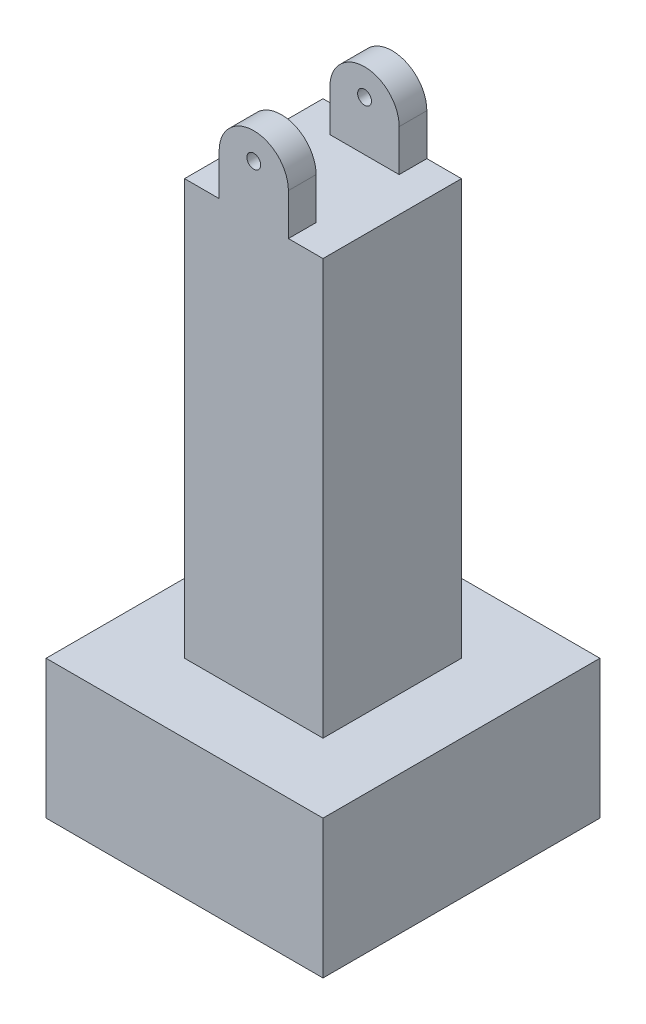
ISO-10303-21;
HEADER;
FILE_DESCRIPTION(('STEP AP214'),'2;1');
FILE_NAME('part.step','',(''),(''),'','','');
FILE_SCHEMA(('AUTOMOTIVE_DESIGN { 1 0 10303 214 1 1 1 1 }'));
ENDSEC;
DATA;
#1=APPLICATION_CONTEXT('core data for automotive mechanical design processes');
#2=APPLICATION_PROTOCOL_DEFINITION('international standard','automotive_design',2000,#1);
#3=PRODUCT_CONTEXT('',#1,'mechanical');
#4=PRODUCT('Part','Part','',(#3));
#5=PRODUCT_RELATED_PRODUCT_CATEGORY('part','',(#4));
#6=PRODUCT_DEFINITION_FORMATION('','',#4);
#7=PRODUCT_DEFINITION_CONTEXT('part definition',#1,'design');
#8=PRODUCT_DEFINITION('design','',#6,#7);
#9=PRODUCT_DEFINITION_SHAPE('','',#8);
#10=(LENGTH_UNIT() NAMED_UNIT(*) SI_UNIT(.MILLI.,.METRE.));
#11=(NAMED_UNIT(*) PLANE_ANGLE_UNIT() SI_UNIT($,.RADIAN.));
#12=(NAMED_UNIT(*) SI_UNIT($,.STERADIAN.) SOLID_ANGLE_UNIT());
#13=UNCERTAINTY_MEASURE_WITH_UNIT(LENGTH_MEASURE(1.E-05),#10,'distance_accuracy_value','');
#14=(GEOMETRIC_REPRESENTATION_CONTEXT(3) GLOBAL_UNCERTAINTY_ASSIGNED_CONTEXT((#13)) GLOBAL_UNIT_ASSIGNED_CONTEXT((#10,
#11,#12)) REPRESENTATION_CONTEXT('',''));
#15=CARTESIAN_POINT('',(0.,0.,0.));
#16=DIRECTION('',(0.,0.,1.));
#17=DIRECTION('',(1.,0.,0.));
#18=AXIS2_PLACEMENT_3D('',#15,#16,#17);
#19=CARTESIAN_POINT('',(0.,40.,0.));
#20=DIRECTION('',(0.,-1.,0.));
#21=DIRECTION('',(0.,0.,-1.));
#22=AXIS2_PLACEMENT_3D('',#19,#20,#21);
#23=PLANE('',#22);
#24=DIRECTION('',(0.,0.,1.));
#25=VECTOR('',#24,1.);
#26=CARTESIAN_POINT('',(-2.5,40.,3.));
#27=LINE('',#26,#25);
#28=CARTESIAN_POINT('',(-2.5,40.,3.));
#29=VERTEX_POINT('',#28);
#30=CARTESIAN_POINT('',(-2.5,40.,5.));
#31=VERTEX_POINT('',#30);
#32=EDGE_CURVE('E200',#29,#31,#27,.T.);
#33=ORIENTED_EDGE('',*,*,#32,.F.);
#34=DIRECTION('',(-1.,0.,0.));
#35=VECTOR('',#34,1.);
#36=CARTESIAN_POINT('',(2.5,40.,3.));
#37=LINE('',#36,#35);
#38=CARTESIAN_POINT('',(2.5,40.,3.));
#39=VERTEX_POINT('',#38);
#40=EDGE_CURVE('E190',#39,#29,#37,.T.);
#41=ORIENTED_EDGE('',*,*,#40,.F.);
#42=DIRECTION('',(0.,0.,-1.));
#43=VECTOR('',#42,1.);
#44=CARTESIAN_POINT('',(2.5,40.,3.));
#45=LINE('',#44,#43);
#46=CARTESIAN_POINT('',(2.5,40.,5.));
#47=VERTEX_POINT('',#46);
#48=EDGE_CURVE('E195',#47,#39,#45,.T.);
#49=ORIENTED_EDGE('',*,*,#48,.F.);
#50=DIRECTION('',(-1.,0.,0.));
#51=VECTOR('',#50,1.);
#52=CARTESIAN_POINT('',(-5.,40.,5.));
#53=LINE('',#52,#51);
#54=CARTESIAN_POINT('',(5.,40.,5.));
#55=VERTEX_POINT('',#54);
#56=EDGE_CURVE('E170',#55,#47,#53,.T.);
#57=ORIENTED_EDGE('',*,*,#56,.F.);
#58=DIRECTION('',(0.,0.,1.));
#59=VECTOR('',#58,1.);
#60=CARTESIAN_POINT('',(5.,40.,5.));
#61=LINE('',#60,#59);
#62=CARTESIAN_POINT('',(5.,40.,-5.));
#63=VERTEX_POINT('',#62);
#64=EDGE_CURVE('E246',#63,#55,#61,.T.);
#65=ORIENTED_EDGE('',*,*,#64,.F.);
#66=DIRECTION('',(1.,0.,0.));
#67=VECTOR('',#66,1.);
#68=CARTESIAN_POINT('',(-5.,40.,-5.));
#69=LINE('',#68,#67);
#70=CARTESIAN_POINT('',(2.5,40.,-5.));
#71=VERTEX_POINT('',#70);
#72=EDGE_CURVE('E258',#71,#63,#69,.T.);
#73=ORIENTED_EDGE('',*,*,#72,.F.);
#74=DIRECTION('',(0.,0.,-1.));
#75=VECTOR('',#74,1.);
#76=CARTESIAN_POINT('',(2.5,40.,-3.));
#77=LINE('',#76,#75);
#78=CARTESIAN_POINT('',(2.5,40.,-3.));
#79=VERTEX_POINT('',#78);
#80=EDGE_CURVE('E218',#79,#71,#77,.T.);
#81=ORIENTED_EDGE('',*,*,#80,.F.);
#82=DIRECTION('',(1.,0.,0.));
#83=VECTOR('',#82,1.);
#84=CARTESIAN_POINT('',(2.5,40.,-3.));
#85=LINE('',#84,#83);
#86=CARTESIAN_POINT('',(-2.5,40.,-3.));
#87=VERTEX_POINT('',#86);
#88=EDGE_CURVE('E63',#87,#79,#85,.T.);
#89=ORIENTED_EDGE('',*,*,#88,.F.);
#90=DIRECTION('',(0.,0.,1.));
#91=VECTOR('',#90,1.);
#92=CARTESIAN_POINT('',(-2.5,40.,-3.));
#93=LINE('',#92,#91);
#94=CARTESIAN_POINT('',(-2.5,40.,-5.));
#95=VERTEX_POINT('',#94);
#96=EDGE_CURVE('E212',#95,#87,#93,.T.);
#97=ORIENTED_EDGE('',*,*,#96,.F.);
#98=CARTESIAN_POINT('',(-5.,40.,-5.));
#99=VERTEX_POINT('',#98);
#100=EDGE_CURVE('E259',#99,#95,#69,.T.);
#101=ORIENTED_EDGE('',*,*,#100,.F.);
#102=DIRECTION('',(0.,0.,-1.));
#103=VECTOR('',#102,1.);
#104=CARTESIAN_POINT('',(-5.,40.,5.));
#105=LINE('',#104,#103);
#106=CARTESIAN_POINT('',(-5.,40.,5.));
#107=VERTEX_POINT('',#106);
#108=EDGE_CURVE('E254',#107,#99,#105,.T.);
#109=ORIENTED_EDGE('',*,*,#108,.F.);
#110=EDGE_CURVE('E250',#31,#107,#53,.T.);
#111=ORIENTED_EDGE('',*,*,#110,.F.);
#112=EDGE_LOOP('',(#33,#41,#49,#57,#65,#73,#81,#89,#97,#101,#109,#111));
#113=FACE_BOUND('',#112,.T.);
#114=ADVANCED_FACE('F38',(#113),#23,.F.);
#115=CARTESIAN_POINT('',(0.,10.,0.));
#116=DIRECTION('',(0.,1.,0.));
#117=DIRECTION('',(0.,0.,1.));
#118=AXIS2_PLACEMENT_3D('',#115,#116,#117);
#119=PLANE('',#118);
#120=DIRECTION('',(0.,0.,-1.));
#121=VECTOR('',#120,1.);
#122=CARTESIAN_POINT('',(10.,10.,-10.));
#123=LINE('',#122,#121);
#124=CARTESIAN_POINT('',(10.,10.,10.));
#125=VERTEX_POINT('',#124);
#126=CARTESIAN_POINT('',(10.,10.,-10.));
#127=VERTEX_POINT('',#126);
#128=EDGE_CURVE('E291',#125,#127,#123,.T.);
#129=ORIENTED_EDGE('',*,*,#128,.T.);
#130=DIRECTION('',(-1.,0.,0.));
#131=VECTOR('',#130,1.);
#132=CARTESIAN_POINT('',(-10.,10.,-10.));
#133=LINE('',#132,#131);
#134=CARTESIAN_POINT('',(-10.,10.,-10.));
#135=VERTEX_POINT('',#134);
#136=EDGE_CURVE('E295',#127,#135,#133,.T.);
#137=ORIENTED_EDGE('',*,*,#136,.T.);
#138=DIRECTION('',(0.,0.,1.));
#139=VECTOR('',#138,1.);
#140=CARTESIAN_POINT('',(-10.,10.,-10.));
#141=LINE('',#140,#139);
#142=CARTESIAN_POINT('',(-10.,10.,10.));
#143=VERTEX_POINT('',#142);
#144=EDGE_CURVE('E299',#135,#143,#141,.T.);
#145=ORIENTED_EDGE('',*,*,#144,.T.);
#146=DIRECTION('',(1.,0.,0.));
#147=VECTOR('',#146,1.);
#148=CARTESIAN_POINT('',(-10.,10.,10.));
#149=LINE('',#148,#147);
#150=EDGE_CURVE('E302',#143,#125,#149,.T.);
#151=ORIENTED_EDGE('',*,*,#150,.T.);
#152=EDGE_LOOP('',(#129,#137,#145,#151));
#153=FACE_BOUND('',#152,.T.);
#154=DIRECTION('',(1.,0.,0.));
#155=VECTOR('',#154,1.);
#156=CARTESIAN_POINT('',(-5.,10.,-5.));
#157=LINE('',#156,#155);
#158=CARTESIAN_POINT('',(-5.,10.,-5.));
#159=VERTEX_POINT('',#158);
#160=CARTESIAN_POINT('',(5.,10.,-5.));
#161=VERTEX_POINT('',#160);
#162=EDGE_CURVE('E251',#159,#161,#157,.T.);
#163=ORIENTED_EDGE('',*,*,#162,.T.);
#164=DIRECTION('',(0.,0.,1.));
#165=VECTOR('',#164,1.);
#166=CARTESIAN_POINT('',(5.,10.,5.));
#167=LINE('',#166,#165);
#168=CARTESIAN_POINT('',(5.,10.,5.));
#169=VERTEX_POINT('',#168);
#170=EDGE_CURVE('E245',#161,#169,#167,.T.);
#171=ORIENTED_EDGE('',*,*,#170,.T.);
#172=DIRECTION('',(-1.,0.,0.));
#173=VECTOR('',#172,1.);
#174=CARTESIAN_POINT('',(-5.,10.,5.));
#175=LINE('',#174,#173);
#176=CARTESIAN_POINT('',(-5.,10.,5.));
#177=VERTEX_POINT('',#176);
#178=EDGE_CURVE('E267',#169,#177,#175,.T.);
#179=ORIENTED_EDGE('',*,*,#178,.T.);
#180=DIRECTION('',(0.,0.,-1.));
#181=VECTOR('',#180,1.);
#182=CARTESIAN_POINT('',(-5.,10.,5.));
#183=LINE('',#182,#181);
#184=EDGE_CURVE('E271',#177,#159,#183,.T.);
#185=ORIENTED_EDGE('',*,*,#184,.T.);
#186=EDGE_LOOP('',(#163,#171,#179,#185));
#187=FACE_BOUND('',#186,.T.);
#188=ADVANCED_FACE('F345',(#153,#187),#119,.T.);
#189=CARTESIAN_POINT('',(10.,10.,-10.));
#190=DIRECTION('',(-1.,0.,0.));
#191=DIRECTION('',(0.,0.,1.));
#192=AXIS2_PLACEMENT_3D('',#189,#190,#191);
#193=PLANE('',#192);
#194=DIRECTION('',(0.,0.,-1.));
#195=VECTOR('',#194,1.);
#196=CARTESIAN_POINT('',(10.,0.,-10.));
#197=LINE('',#196,#195);
#198=CARTESIAN_POINT('',(10.,0.,10.));
#199=VERTEX_POINT('',#198);
#200=CARTESIAN_POINT('',(10.,0.,-10.));
#201=VERTEX_POINT('',#200);
#202=EDGE_CURVE('E282',#199,#201,#197,.T.);
#203=ORIENTED_EDGE('',*,*,#202,.T.);
#204=DIRECTION('',(0.,-1.,0.));
#205=VECTOR('',#204,1.);
#206=CARTESIAN_POINT('',(10.,10.,-10.));
#207=LINE('',#206,#205);
#208=EDGE_CURVE('E11',#127,#201,#207,.T.);
#209=ORIENTED_EDGE('',*,*,#208,.F.);
#210=ORIENTED_EDGE('',*,*,#128,.F.);
#211=DIRECTION('',(0.,-1.,0.));
#212=VECTOR('',#211,1.);
#213=CARTESIAN_POINT('',(10.,10.,10.));
#214=LINE('',#213,#212);
#215=EDGE_CURVE('E305',#125,#199,#214,.T.);
#216=ORIENTED_EDGE('',*,*,#215,.T.);
#217=EDGE_LOOP('',(#203,#209,#210,#216));
#218=FACE_BOUND('',#217,.T.);
#219=ADVANCED_FACE('F40',(#218),#193,.F.);
#220=CARTESIAN_POINT('',(-10.,10.,-10.));
#221=DIRECTION('',(0.,0.,1.));
#222=DIRECTION('',(1.,0.,0.));
#223=AXIS2_PLACEMENT_3D('',#220,#221,#222);
#224=PLANE('',#223);
#225=DIRECTION('',(-1.,0.,0.));
#226=VECTOR('',#225,1.);
#227=CARTESIAN_POINT('',(-10.,0.,-10.));
#228=LINE('',#227,#226);
#229=CARTESIAN_POINT('',(-10.,0.,-10.));
#230=VERTEX_POINT('',#229);
#231=EDGE_CURVE('E309',#201,#230,#228,.T.);
#232=ORIENTED_EDGE('',*,*,#231,.T.);
#233=DIRECTION('',(0.,-1.,0.));
#234=VECTOR('',#233,1.);
#235=CARTESIAN_POINT('',(-10.,10.,-10.));
#236=LINE('',#235,#234);
#237=EDGE_CURVE('E48',#135,#230,#236,.T.);
#238=ORIENTED_EDGE('',*,*,#237,.F.);
#239=ORIENTED_EDGE('',*,*,#136,.F.);
#240=ORIENTED_EDGE('',*,*,#208,.T.);
#241=EDGE_LOOP('',(#232,#238,#239,#240));
#242=FACE_BOUND('',#241,.T.);
#243=ADVANCED_FACE('F347',(#242),#224,.F.);
#244=CARTESIAN_POINT('',(-10.,10.,-10.));
#245=DIRECTION('',(1.,0.,0.));
#246=DIRECTION('',(0.,0.,-1.));
#247=AXIS2_PLACEMENT_3D('',#244,#245,#246);
#248=PLANE('',#247);
#249=DIRECTION('',(0.,0.,1.));
#250=VECTOR('',#249,1.);
#251=CARTESIAN_POINT('',(-10.,0.,-10.));
#252=LINE('',#251,#250);
#253=CARTESIAN_POINT('',(-10.,0.,10.));
#254=VERTEX_POINT('',#253);
#255=EDGE_CURVE('E312',#230,#254,#252,.T.);
#256=ORIENTED_EDGE('',*,*,#255,.T.);
#257=DIRECTION('',(0.,-1.,0.));
#258=VECTOR('',#257,1.);
#259=CARTESIAN_POINT('',(-10.,10.,10.));
#260=LINE('',#259,#258);
#261=EDGE_CURVE('E320',#143,#254,#260,.T.);
#262=ORIENTED_EDGE('',*,*,#261,.F.);
#263=ORIENTED_EDGE('',*,*,#144,.F.);
#264=ORIENTED_EDGE('',*,*,#237,.T.);
#265=EDGE_LOOP('',(#256,#262,#263,#264));
#266=FACE_BOUND('',#265,.T.);
#267=ADVANCED_FACE('F330',(#266),#248,.F.);
#268=CARTESIAN_POINT('',(-10.,10.,10.));
#269=DIRECTION('',(0.,0.,-1.));
#270=DIRECTION('',(-1.,0.,0.));
#271=AXIS2_PLACEMENT_3D('',#268,#269,#270);
#272=PLANE('',#271);
#273=DIRECTION('',(1.,0.,0.));
#274=VECTOR('',#273,1.);
#275=CARTESIAN_POINT('',(-10.,0.,10.));
#276=LINE('',#275,#274);
#277=EDGE_CURVE('E296',#254,#199,#276,.T.);
#278=ORIENTED_EDGE('',*,*,#277,.T.);
#279=ORIENTED_EDGE('',*,*,#215,.F.);
#280=ORIENTED_EDGE('',*,*,#150,.F.);
#281=ORIENTED_EDGE('',*,*,#261,.T.);
#282=EDGE_LOOP('',(#278,#279,#280,#281));
#283=FACE_BOUND('',#282,.T.);
#284=ADVANCED_FACE('F339',(#283),#272,.F.);
#285=CARTESIAN_POINT('',(0.,0.,0.));
#286=DIRECTION('',(0.,1.,0.));
#287=DIRECTION('',(0.,0.,1.));
#288=AXIS2_PLACEMENT_3D('',#285,#286,#287);
#289=PLANE('',#288);
#290=ORIENTED_EDGE('',*,*,#202,.F.);
#291=ORIENTED_EDGE('',*,*,#277,.F.);
#292=ORIENTED_EDGE('',*,*,#255,.F.);
#293=ORIENTED_EDGE('',*,*,#231,.F.);
#294=EDGE_LOOP('',(#290,#291,#292,#293));
#295=FACE_BOUND('',#294,.T.);
#296=ADVANCED_FACE('F336',(#295),#289,.F.);
#297=CARTESIAN_POINT('',(5.,40.,5.));
#298=DIRECTION('',(1.,0.,0.));
#299=DIRECTION('',(0.,0.,-1.));
#300=AXIS2_PLACEMENT_3D('',#297,#298,#299);
#301=PLANE('',#300);
#302=ORIENTED_EDGE('',*,*,#170,.F.);
#303=DIRECTION('',(0.,-1.,0.));
#304=VECTOR('',#303,1.);
#305=CARTESIAN_POINT('',(5.,40.,-5.));
#306=LINE('',#305,#304);
#307=EDGE_CURVE('E278',#63,#161,#306,.T.);
#308=ORIENTED_EDGE('',*,*,#307,.F.);
#309=ORIENTED_EDGE('',*,*,#64,.T.);
#310=DIRECTION('',(0.,-1.,0.));
#311=VECTOR('',#310,1.);
#312=CARTESIAN_POINT('',(5.,40.,5.));
#313=LINE('',#312,#311);
#314=EDGE_CURVE('E263',#55,#169,#313,.T.);
#315=ORIENTED_EDGE('',*,*,#314,.T.);
#316=EDGE_LOOP('',(#302,#308,#309,#315));
#317=FACE_BOUND('',#316,.T.);
#318=ADVANCED_FACE('F369',(#317),#301,.T.);
#319=CARTESIAN_POINT('',(-5.,40.,-5.));
#320=DIRECTION('',(0.,0.,-1.));
#321=DIRECTION('',(-1.,0.,0.));
#322=AXIS2_PLACEMENT_3D('',#319,#320,#321);
#323=PLANE('',#322);
#324=CARTESIAN_POINT('',(0.,43.5891700618812,-5.));
#325=DIRECTION('',(0.,0.,-1.));
#326=DIRECTION('',(-1.,0.,0.));
#327=AXIS2_PLACEMENT_3D('',#324,#325,#326);
#328=CIRCLE('',#327,0.5);
#329=CARTESIAN_POINT('',(-0.499999999999999,43.5891700618812,-5.));
#330=VERTEX_POINT('',#329);
#331=EDGE_CURVE('E503',#330,#330,#328,.T.);
#332=ORIENTED_EDGE('',*,*,#331,.F.);
#333=EDGE_LOOP('',(#332));
#334=FACE_BOUND('',#333,.T.);
#335=DIRECTION('',(0.,-1.,0.));
#336=VECTOR('',#335,1.);
#337=CARTESIAN_POINT('',(-2.5,43.,-5.));
#338=LINE('',#337,#336);
#339=CARTESIAN_POINT('',(-2.5,43.,-5.));
#340=VERTEX_POINT('',#339);
#341=EDGE_CURVE('E222',#340,#95,#338,.T.);
#342=ORIENTED_EDGE('',*,*,#341,.F.);
#343=CARTESIAN_POINT('',(0.,43.,-5.));
#344=DIRECTION('',(0.,0.,-1.));
#345=DIRECTION('',(-1.,0.,0.));
#346=AXIS2_PLACEMENT_3D('',#343,#344,#345);
#347=CIRCLE('',#346,2.5);
#348=CARTESIAN_POINT('',(2.5,43.,-5.));
#349=VERTEX_POINT('',#348);
#350=EDGE_CURVE('E181',#340,#349,#347,.T.);
#351=ORIENTED_EDGE('',*,*,#350,.T.);
#352=DIRECTION('',(0.,-1.,0.));
#353=VECTOR('',#352,1.);
#354=CARTESIAN_POINT('',(2.5,43.,-5.));
#355=LINE('',#354,#353);
#356=EDGE_CURVE('E234',#349,#71,#355,.T.);
#357=ORIENTED_EDGE('',*,*,#356,.T.);
#358=ORIENTED_EDGE('',*,*,#72,.T.);
#359=ORIENTED_EDGE('',*,*,#307,.T.);
#360=ORIENTED_EDGE('',*,*,#162,.F.);
#361=DIRECTION('',(0.,-1.,0.));
#362=VECTOR('',#361,1.);
#363=CARTESIAN_POINT('',(-5.,40.,-5.));
#364=LINE('',#363,#362);
#365=EDGE_CURVE('E283',#99,#159,#364,.T.);
#366=ORIENTED_EDGE('',*,*,#365,.F.);
#367=ORIENTED_EDGE('',*,*,#100,.T.);
#368=EDGE_LOOP('',(#342,#351,#357,#358,#359,#360,#366,#367));
#369=FACE_BOUND('',#368,.T.);
#370=ADVANCED_FACE('F365',(#334,#369),#323,.T.);
#371=CARTESIAN_POINT('',(-5.,40.,5.));
#372=DIRECTION('',(-1.,0.,0.));
#373=DIRECTION('',(0.,0.,1.));
#374=AXIS2_PLACEMENT_3D('',#371,#372,#373);
#375=PLANE('',#374);
#376=ORIENTED_EDGE('',*,*,#184,.F.);
#377=DIRECTION('',(0.,-1.,0.));
#378=VECTOR('',#377,1.);
#379=CARTESIAN_POINT('',(-5.,40.,5.));
#380=LINE('',#379,#378);
#381=EDGE_CURVE('E286',#107,#177,#380,.T.);
#382=ORIENTED_EDGE('',*,*,#381,.F.);
#383=ORIENTED_EDGE('',*,*,#108,.T.);
#384=ORIENTED_EDGE('',*,*,#365,.T.);
#385=EDGE_LOOP('',(#376,#382,#383,#384));
#386=FACE_BOUND('',#385,.T.);
#387=ADVANCED_FACE('F368',(#386),#375,.T.);
#388=CARTESIAN_POINT('',(-5.,40.,5.));
#389=DIRECTION('',(0.,0.,1.));
#390=DIRECTION('',(1.,0.,0.));
#391=AXIS2_PLACEMENT_3D('',#388,#389,#390);
#392=PLANE('',#391);
#393=CARTESIAN_POINT('',(0.,43.5891700618812,5.));
#394=DIRECTION('',(0.,0.,-1.));
#395=DIRECTION('',(-1.,0.,0.));
#396=AXIS2_PLACEMENT_3D('',#393,#394,#395);
#397=CIRCLE('',#396,0.5);
#398=CARTESIAN_POINT('',(-0.500000000000001,43.5891700618812,5.));
#399=VERTEX_POINT('',#398);
#400=EDGE_CURVE('E526',#399,#399,#397,.T.);
#401=ORIENTED_EDGE('',*,*,#400,.T.);
#402=EDGE_LOOP('',(#401));
#403=FACE_BOUND('',#402,.T.);
#404=DIRECTION('',(0.,-1.,0.));
#405=VECTOR('',#404,1.);
#406=CARTESIAN_POINT('',(2.5,43.,5.));
#407=LINE('',#406,#405);
#408=CARTESIAN_POINT('',(2.5,43.,5.));
#409=VERTEX_POINT('',#408);
#410=EDGE_CURVE('E155',#409,#47,#407,.T.);
#411=ORIENTED_EDGE('',*,*,#410,.F.);
#412=CARTESIAN_POINT('',(0.,43.,5.));
#413=DIRECTION('',(0.,0.,-1.));
#414=DIRECTION('',(-1.,0.,0.));
#415=AXIS2_PLACEMENT_3D('',#412,#413,#414);
#416=CIRCLE('',#415,2.5);
#417=CARTESIAN_POINT('',(-2.5,43.,5.));
#418=VERTEX_POINT('',#417);
#419=EDGE_CURVE('E168',#418,#409,#416,.T.);
#420=ORIENTED_EDGE('',*,*,#419,.F.);
#421=DIRECTION('',(0.,-1.,0.));
#422=VECTOR('',#421,1.);
#423=CARTESIAN_POINT('',(-2.5,43.,5.));
#424=LINE('',#423,#422);
#425=EDGE_CURVE('E55',#418,#31,#424,.T.);
#426=ORIENTED_EDGE('',*,*,#425,.T.);
#427=ORIENTED_EDGE('',*,*,#110,.T.);
#428=ORIENTED_EDGE('',*,*,#381,.T.);
#429=ORIENTED_EDGE('',*,*,#178,.F.);
#430=ORIENTED_EDGE('',*,*,#314,.F.);
#431=ORIENTED_EDGE('',*,*,#56,.T.);
#432=EDGE_LOOP('',(#411,#420,#426,#427,#428,#429,#430,#431));
#433=FACE_BOUND('',#432,.T.);
#434=ADVANCED_FACE('F167',(#403,#433),#392,.T.);
#435=CARTESIAN_POINT('',(-2.5,43.,-3.));
#436=DIRECTION('',(1.,0.,0.));
#437=DIRECTION('',(0.,0.,-1.));
#438=AXIS2_PLACEMENT_3D('',#435,#436,#437);
#439=PLANE('',#438);
#440=ORIENTED_EDGE('',*,*,#96,.T.);
#441=DIRECTION('',(0.,-1.,0.));
#442=VECTOR('',#441,1.);
#443=CARTESIAN_POINT('',(-2.5,43.,-3.));
#444=LINE('',#443,#442);
#445=CARTESIAN_POINT('',(-2.5,43.,-3.));
#446=VERTEX_POINT('',#445);
#447=EDGE_CURVE('E242',#446,#87,#444,.T.);
#448=ORIENTED_EDGE('',*,*,#447,.F.);
#449=DIRECTION('',(0.,0.,1.));
#450=VECTOR('',#449,1.);
#451=CARTESIAN_POINT('',(-2.5,43.,-3.));
#452=LINE('',#451,#450);
#453=EDGE_CURVE('E213',#340,#446,#452,.T.);
#454=ORIENTED_EDGE('',*,*,#453,.F.);
#455=ORIENTED_EDGE('',*,*,#341,.T.);
#456=EDGE_LOOP('',(#440,#448,#454,#455));
#457=FACE_BOUND('',#456,.T.);
#458=ADVANCED_FACE('F363',(#457),#439,.F.);
#459=CARTESIAN_POINT('',(2.5,43.,-3.));
#460=DIRECTION('',(0.,0.,-1.));
#461=DIRECTION('',(-1.,0.,0.));
#462=AXIS2_PLACEMENT_3D('',#459,#460,#461);
#463=PLANE('',#462);
#464=CARTESIAN_POINT('',(0.,43.5891700618812,-3.));
#465=DIRECTION('',(0.,0.,-1.));
#466=DIRECTION('',(-1.,0.,0.));
#467=AXIS2_PLACEMENT_3D('',#464,#465,#466);
#468=CIRCLE('',#467,0.5);
#469=CARTESIAN_POINT('',(-0.5,43.5891700618812,-3.));
#470=VERTEX_POINT('',#469);
#471=EDGE_CURVE('E177',#470,#470,#468,.T.);
#472=ORIENTED_EDGE('',*,*,#471,.T.);
#473=EDGE_LOOP('',(#472));
#474=FACE_BOUND('',#473,.T.);
#475=DIRECTION('',(0.,-1.,0.));
#476=VECTOR('',#475,1.);
#477=CARTESIAN_POINT('',(2.5,43.,-3.));
#478=LINE('',#477,#476);
#479=CARTESIAN_POINT('',(2.5,43.,-3.));
#480=VERTEX_POINT('',#479);
#481=EDGE_CURVE('E238',#480,#79,#478,.T.);
#482=ORIENTED_EDGE('',*,*,#481,.F.);
#483=CARTESIAN_POINT('',(0.,43.,-3.));
#484=DIRECTION('',(0.,0.,-1.));
#485=DIRECTION('',(-1.,0.,0.));
#486=AXIS2_PLACEMENT_3D('',#483,#484,#485);
#487=CIRCLE('',#486,2.5);
#488=EDGE_CURVE('E186',#446,#480,#487,.T.);
#489=ORIENTED_EDGE('',*,*,#488,.F.);
#490=ORIENTED_EDGE('',*,*,#447,.T.);
#491=ORIENTED_EDGE('',*,*,#88,.T.);
#492=EDGE_LOOP('',(#482,#489,#490,#491));
#493=FACE_BOUND('',#492,.T.);
#494=ADVANCED_FACE('F426',(#474,#493),#463,.F.);
#495=CARTESIAN_POINT('',(2.5,43.,-3.));
#496=DIRECTION('',(-1.,0.,0.));
#497=DIRECTION('',(0.,0.,1.));
#498=AXIS2_PLACEMENT_3D('',#495,#496,#497);
#499=PLANE('',#498);
#500=ORIENTED_EDGE('',*,*,#80,.T.);
#501=ORIENTED_EDGE('',*,*,#356,.F.);
#502=DIRECTION('',(0.,0.,-1.));
#503=VECTOR('',#502,1.);
#504=CARTESIAN_POINT('',(2.5,43.,-3.));
#505=LINE('',#504,#503);
#506=EDGE_CURVE('E217',#480,#349,#505,.T.);
#507=ORIENTED_EDGE('',*,*,#506,.F.);
#508=ORIENTED_EDGE('',*,*,#481,.T.);
#509=EDGE_LOOP('',(#500,#501,#507,#508));
#510=FACE_BOUND('',#509,.T.);
#511=ADVANCED_FACE('F433',(#510),#499,.F.);
#512=CARTESIAN_POINT('',(2.5,43.,3.));
#513=DIRECTION('',(0.,0.,1.));
#514=DIRECTION('',(1.,0.,0.));
#515=AXIS2_PLACEMENT_3D('',#512,#513,#514);
#516=PLANE('',#515);
#517=CARTESIAN_POINT('',(0.,43.5891700618812,3.));
#518=DIRECTION('',(0.,0.,1.));
#519=DIRECTION('',(1.,0.,0.));
#520=AXIS2_PLACEMENT_3D('',#517,#518,#519);
#521=CIRCLE('',#520,0.5);
#522=CARTESIAN_POINT('',(0.5,43.5891700618812,3.));
#523=VERTEX_POINT('',#522);
#524=EDGE_CURVE('E42',#523,#523,#521,.T.);
#525=ORIENTED_EDGE('',*,*,#524,.T.);
#526=EDGE_LOOP('',(#525));
#527=FACE_BOUND('',#526,.T.);
#528=DIRECTION('',(0.,-1.,0.));
#529=VECTOR('',#528,1.);
#530=CARTESIAN_POINT('',(-2.5,43.,3.));
#531=LINE('',#530,#529);
#532=CARTESIAN_POINT('',(-2.5,43.,3.));
#533=VERTEX_POINT('',#532);
#534=EDGE_CURVE('E209',#533,#29,#531,.T.);
#535=ORIENTED_EDGE('',*,*,#534,.F.);
#536=CARTESIAN_POINT('',(0.,43.,3.));
#537=DIRECTION('',(0.,0.,-1.));
#538=DIRECTION('',(-1.,0.,0.));
#539=AXIS2_PLACEMENT_3D('',#536,#537,#538);
#540=CIRCLE('',#539,2.5);
#541=CARTESIAN_POINT('',(2.5,43.,3.));
#542=VERTEX_POINT('',#541);
#543=EDGE_CURVE('E176',#533,#542,#540,.T.);
#544=ORIENTED_EDGE('',*,*,#543,.T.);
#545=DIRECTION('',(0.,-1.,0.));
#546=VECTOR('',#545,1.);
#547=CARTESIAN_POINT('',(2.5,43.,3.));
#548=LINE('',#547,#546);
#549=EDGE_CURVE('E158',#542,#39,#548,.T.);
#550=ORIENTED_EDGE('',*,*,#549,.T.);
#551=ORIENTED_EDGE('',*,*,#40,.T.);
#552=EDGE_LOOP('',(#535,#544,#550,#551));
#553=FACE_BOUND('',#552,.T.);
#554=ADVANCED_FACE('F442',(#527,#553),#516,.F.);
#555=CARTESIAN_POINT('',(-2.5,43.,3.));
#556=DIRECTION('',(1.,0.,0.));
#557=DIRECTION('',(0.,0.,-1.));
#558=AXIS2_PLACEMENT_3D('',#555,#556,#557);
#559=PLANE('',#558);
#560=ORIENTED_EDGE('',*,*,#32,.T.);
#561=ORIENTED_EDGE('',*,*,#425,.F.);
#562=DIRECTION('',(0.,0.,1.));
#563=VECTOR('',#562,1.);
#564=CARTESIAN_POINT('',(-2.5,43.,3.));
#565=LINE('',#564,#563);
#566=EDGE_CURVE('E164',#533,#418,#565,.T.);
#567=ORIENTED_EDGE('',*,*,#566,.F.);
#568=ORIENTED_EDGE('',*,*,#534,.T.);
#569=EDGE_LOOP('',(#560,#561,#567,#568));
#570=FACE_BOUND('',#569,.T.);
#571=ADVANCED_FACE('F450',(#570),#559,.F.);
#572=CARTESIAN_POINT('',(2.5,43.,3.));
#573=DIRECTION('',(-1.,0.,0.));
#574=DIRECTION('',(0.,0.,1.));
#575=AXIS2_PLACEMENT_3D('',#572,#573,#574);
#576=PLANE('',#575);
#577=ORIENTED_EDGE('',*,*,#48,.T.);
#578=ORIENTED_EDGE('',*,*,#549,.F.);
#579=DIRECTION('',(0.,0.,-1.));
#580=VECTOR('',#579,1.);
#581=CARTESIAN_POINT('',(2.5,43.,3.));
#582=LINE('',#581,#580);
#583=EDGE_CURVE('E152',#409,#542,#582,.T.);
#584=ORIENTED_EDGE('',*,*,#583,.F.);
#585=ORIENTED_EDGE('',*,*,#410,.T.);
#586=EDGE_LOOP('',(#577,#578,#584,#585));
#587=FACE_BOUND('',#586,.T.);
#588=ADVANCED_FACE('F154',(#587),#576,.F.);
#589=CARTESIAN_POINT('',(0.,43.,-3.));
#590=DIRECTION('',(0.,0.,-1.));
#591=DIRECTION('',(-1.,0.,0.));
#592=AXIS2_PLACEMENT_3D('',#589,#590,#591);
#593=CYLINDRICAL_SURFACE('',#592,2.5);
#594=ORIENTED_EDGE('',*,*,#488,.T.);
#595=ORIENTED_EDGE('',*,*,#506,.T.);
#596=ORIENTED_EDGE('',*,*,#350,.F.);
#597=ORIENTED_EDGE('',*,*,#453,.T.);
#598=EDGE_LOOP('',(#594,#595,#596,#597));
#599=FACE_BOUND('',#598,.T.);
#600=ADVANCED_FACE('F469',(#599),#593,.T.);
#601=CARTESIAN_POINT('',(0.,43.,3.));
#602=DIRECTION('',(0.,0.,1.));
#603=DIRECTION('',(1.,0.,0.));
#604=AXIS2_PLACEMENT_3D('',#601,#602,#603);
#605=CYLINDRICAL_SURFACE('',#604,2.5);
#606=ORIENTED_EDGE('',*,*,#566,.T.);
#607=ORIENTED_EDGE('',*,*,#419,.T.);
#608=ORIENTED_EDGE('',*,*,#583,.T.);
#609=ORIENTED_EDGE('',*,*,#543,.F.);
#610=EDGE_LOOP('',(#606,#607,#608,#609));
#611=FACE_BOUND('',#610,.T.);
#612=ADVANCED_FACE('F174',(#611),#605,.T.);
#613=CARTESIAN_POINT('',(0.,43.5891700618812,5.));
#614=DIRECTION('',(0.,0.,-1.));
#615=DIRECTION('',(-1.,0.,0.));
#616=AXIS2_PLACEMENT_3D('',#613,#614,#615);
#617=CYLINDRICAL_SURFACE('',#616,0.5);
#618=ORIENTED_EDGE('',*,*,#400,.F.);
#619=EDGE_LOOP('',(#618));
#620=FACE_BOUND('',#619,.T.);
#621=ORIENTED_EDGE('',*,*,#524,.F.);
#622=EDGE_LOOP('',(#621));
#623=FACE_BOUND('',#622,.T.);
#624=ADVANCED_FACE('F479',(#620,#623),#617,.F.);
#625=ORIENTED_EDGE('',*,*,#331,.T.);
#626=EDGE_LOOP('',(#625));
#627=FACE_BOUND('',#626,.T.);
#628=ORIENTED_EDGE('',*,*,#471,.F.);
#629=EDGE_LOOP('',(#628));
#630=FACE_BOUND('',#629,.T.);
#631=ADVANCED_FACE('F484',(#627,#630),#617,.F.);
#632=CLOSED_SHELL('',(#114,#188,#219,#243,#267,#284,#296,#318,#370,#387,#434,#458,#494,#511,
#554,#571,#588,#600,#612,#624,#631));
#633=MANIFOLD_SOLID_BREP('B2',#632);
#634=ADVANCED_BREP_SHAPE_REPRESENTATION('',(#18,#633),#14);
#635=SHAPE_DEFINITION_REPRESENTATION(#9,#634);
ENDSEC;
END-ISO-10303-21;
